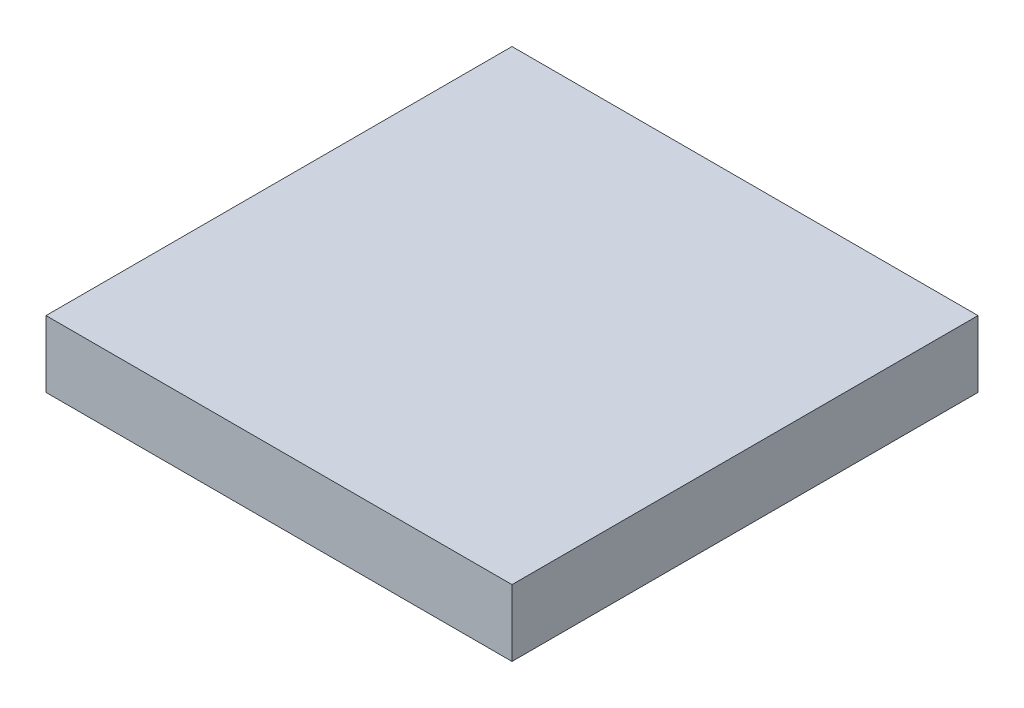
ISO-10303-21;
HEADER;
FILE_DESCRIPTION(('STEP AP214'),'2;1');
FILE_NAME('part.step','',(''),(''),'','','');
FILE_SCHEMA(('AUTOMOTIVE_DESIGN { 1 0 10303 214 1 1 1 1 }'));
ENDSEC;
DATA;
#1=APPLICATION_CONTEXT('core data for automotive mechanical design processes');
#2=APPLICATION_PROTOCOL_DEFINITION('international standard','automotive_design',2000,#1);
#3=PRODUCT_CONTEXT('',#1,'mechanical');
#4=PRODUCT('Part','Part','',(#3));
#5=PRODUCT_RELATED_PRODUCT_CATEGORY('part','',(#4));
#6=PRODUCT_DEFINITION_FORMATION('','',#4);
#7=PRODUCT_DEFINITION_CONTEXT('part definition',#1,'design');
#8=PRODUCT_DEFINITION('design','',#6,#7);
#9=PRODUCT_DEFINITION_SHAPE('','',#8);
#10=(LENGTH_UNIT() NAMED_UNIT(*) SI_UNIT(.MILLI.,.METRE.));
#11=(NAMED_UNIT(*) PLANE_ANGLE_UNIT() SI_UNIT($,.RADIAN.));
#12=(NAMED_UNIT(*) SI_UNIT($,.STERADIAN.) SOLID_ANGLE_UNIT());
#13=UNCERTAINTY_MEASURE_WITH_UNIT(LENGTH_MEASURE(1.E-05),#10,'distance_accuracy_value','');
#14=(GEOMETRIC_REPRESENTATION_CONTEXT(3) GLOBAL_UNCERTAINTY_ASSIGNED_CONTEXT((#13)) GLOBAL_UNIT_ASSIGNED_CONTEXT((#10,
#11,#12)) REPRESENTATION_CONTEXT('',''));
#15=CARTESIAN_POINT('',(0.,0.,0.));
#16=DIRECTION('',(0.,0.,1.));
#17=DIRECTION('',(1.,0.,0.));
#18=AXIS2_PLACEMENT_3D('',#15,#16,#17);
#19=CARTESIAN_POINT('',(9.15,6.8,-37.4));
#20=DIRECTION('',(0.,-1.,0.));
#21=DIRECTION('',(0.,0.,-1.));
#22=AXIS2_PLACEMENT_3D('',#19,#20,#21);
#23=PLANE('',#22);
#24=DIRECTION('',(-1.,0.,0.));
#25=VECTOR('',#24,1.);
#26=CARTESIAN_POINT('',(12.65,6.8,-44.4));
#27=LINE('',#26,#25);
#28=CARTESIAN_POINT('',(16.15,6.8,-44.4));
#29=VERTEX_POINT('',#28);
#30=CARTESIAN_POINT('',(9.15,6.8,-44.4));
#31=VERTEX_POINT('',#30);
#32=EDGE_CURVE('E54',#29,#31,#27,.T.);
#33=ORIENTED_EDGE('',*,*,#32,.F.);
#34=DIRECTION('',(0.,0.,-1.));
#35=VECTOR('',#34,1.);
#36=CARTESIAN_POINT('',(16.15,6.8,-40.9));
#37=LINE('',#36,#35);
#38=CARTESIAN_POINT('',(16.15,6.8,-37.4));
#39=VERTEX_POINT('',#38);
#40=EDGE_CURVE('E69',#39,#29,#37,.T.);
#41=ORIENTED_EDGE('',*,*,#40,.F.);
#42=DIRECTION('',(1.,0.,0.));
#43=VECTOR('',#42,1.);
#44=CARTESIAN_POINT('',(12.65,6.8,-37.4));
#45=LINE('',#44,#43);
#46=CARTESIAN_POINT('',(9.15,6.8,-37.4));
#47=VERTEX_POINT('',#46);
#48=EDGE_CURVE('E21',#47,#39,#45,.T.);
#49=ORIENTED_EDGE('',*,*,#48,.F.);
#50=DIRECTION('',(0.,0.,1.));
#51=VECTOR('',#50,1.);
#52=CARTESIAN_POINT('',(9.15,6.8,-40.9));
#53=LINE('',#52,#51);
#54=EDGE_CURVE('E59',#31,#47,#53,.T.);
#55=ORIENTED_EDGE('',*,*,#54,.F.);
#56=EDGE_LOOP('',(#33,#41,#49,#55));
#57=FACE_BOUND('',#56,.T.);
#58=ADVANCED_FACE('F17',(#57),#23,.T.);
#59=CARTESIAN_POINT('',(16.15,7.8,-37.4));
#60=DIRECTION('',(0.,0.,1.));
#61=DIRECTION('',(-1.,0.,0.));
#62=AXIS2_PLACEMENT_3D('',#59,#60,#61);
#63=PLANE('',#62);
#64=ORIENTED_EDGE('',*,*,#48,.T.);
#65=DIRECTION('',(0.,-1.,0.));
#66=VECTOR('',#65,1.);
#67=CARTESIAN_POINT('',(16.15,7.3,-37.4));
#68=LINE('',#67,#66);
#69=CARTESIAN_POINT('',(16.15,7.8,-37.4));
#70=VERTEX_POINT('',#69);
#71=EDGE_CURVE('E80',#70,#39,#68,.T.);
#72=ORIENTED_EDGE('',*,*,#71,.F.);
#73=DIRECTION('',(-1.,0.,0.));
#74=VECTOR('',#73,1.);
#75=CARTESIAN_POINT('',(12.65,7.8,-37.4));
#76=LINE('',#75,#74);
#77=CARTESIAN_POINT('',(9.15,7.8,-37.4));
#78=VERTEX_POINT('',#77);
#79=EDGE_CURVE('E75',#70,#78,#76,.T.);
#80=ORIENTED_EDGE('',*,*,#79,.T.);
#81=DIRECTION('',(0.,1.,0.));
#82=VECTOR('',#81,1.);
#83=CARTESIAN_POINT('',(9.15,7.3,-37.4));
#84=LINE('',#83,#82);
#85=EDGE_CURVE('E64',#47,#78,#84,.T.);
#86=ORIENTED_EDGE('',*,*,#85,.F.);
#87=EDGE_LOOP('',(#64,#72,#80,#86));
#88=FACE_BOUND('',#87,.T.);
#89=ADVANCED_FACE('F74',(#88),#63,.T.);
#90=CARTESIAN_POINT('',(9.15,7.8,-37.4));
#91=DIRECTION('',(-1.,0.,0.));
#92=DIRECTION('',(0.,0.,-1.));
#93=AXIS2_PLACEMENT_3D('',#90,#91,#92);
#94=PLANE('',#93);
#95=ORIENTED_EDGE('',*,*,#54,.T.);
#96=ORIENTED_EDGE('',*,*,#85,.T.);
#97=DIRECTION('',(0.,0.,-1.));
#98=VECTOR('',#97,1.);
#99=CARTESIAN_POINT('',(9.15,7.8,-40.9));
#100=LINE('',#99,#98);
#101=CARTESIAN_POINT('',(9.15,7.8,-44.4));
#102=VERTEX_POINT('',#101);
#103=EDGE_CURVE('E85',#78,#102,#100,.T.);
#104=ORIENTED_EDGE('',*,*,#103,.T.);
#105=DIRECTION('',(0.,1.,0.));
#106=VECTOR('',#105,1.);
#107=CARTESIAN_POINT('',(9.15,7.3,-44.4));
#108=LINE('',#107,#106);
#109=EDGE_CURVE('E66',#31,#102,#108,.T.);
#110=ORIENTED_EDGE('',*,*,#109,.F.);
#111=EDGE_LOOP('',(#95,#96,#104,#110));
#112=FACE_BOUND('',#111,.T.);
#113=ADVANCED_FACE('F61',(#112),#94,.T.);
#114=CARTESIAN_POINT('',(9.15,7.8,-44.4));
#115=DIRECTION('',(0.,0.,-1.));
#116=DIRECTION('',(1.,0.,0.));
#117=AXIS2_PLACEMENT_3D('',#114,#115,#116);
#118=PLANE('',#117);
#119=ORIENTED_EDGE('',*,*,#32,.T.);
#120=ORIENTED_EDGE('',*,*,#109,.T.);
#121=DIRECTION('',(1.,0.,0.));
#122=VECTOR('',#121,1.);
#123=CARTESIAN_POINT('',(12.65,7.8,-44.4));
#124=LINE('',#123,#122);
#125=CARTESIAN_POINT('',(16.15,7.8,-44.4));
#126=VERTEX_POINT('',#125);
#127=EDGE_CURVE('E27',#102,#126,#124,.T.);
#128=ORIENTED_EDGE('',*,*,#127,.T.);
#129=DIRECTION('',(0.,1.,0.));
#130=VECTOR('',#129,1.);
#131=CARTESIAN_POINT('',(16.15,7.3,-44.4));
#132=LINE('',#131,#130);
#133=EDGE_CURVE('E35',#29,#126,#132,.T.);
#134=ORIENTED_EDGE('',*,*,#133,.F.);
#135=EDGE_LOOP('',(#119,#120,#128,#134));
#136=FACE_BOUND('',#135,.T.);
#137=ADVANCED_FACE('F89',(#136),#118,.T.);
#138=CARTESIAN_POINT('',(16.15,7.8,-44.4));
#139=DIRECTION('',(1.,0.,0.));
#140=DIRECTION('',(0.,0.,1.));
#141=AXIS2_PLACEMENT_3D('',#138,#139,#140);
#142=PLANE('',#141);
#143=ORIENTED_EDGE('',*,*,#40,.T.);
#144=ORIENTED_EDGE('',*,*,#133,.T.);
#145=DIRECTION('',(0.,0.,1.));
#146=VECTOR('',#145,1.);
#147=CARTESIAN_POINT('',(16.15,7.8,-40.9));
#148=LINE('',#147,#146);
#149=EDGE_CURVE('E11',#126,#70,#148,.T.);
#150=ORIENTED_EDGE('',*,*,#149,.T.);
#151=ORIENTED_EDGE('',*,*,#71,.T.);
#152=EDGE_LOOP('',(#143,#144,#150,#151));
#153=FACE_BOUND('',#152,.T.);
#154=ADVANCED_FACE('F91',(#153),#142,.T.);
#155=CARTESIAN_POINT('',(9.15,7.8,-37.4));
#156=DIRECTION('',(0.,-1.,0.));
#157=DIRECTION('',(0.,0.,-1.));
#158=AXIS2_PLACEMENT_3D('',#155,#156,#157);
#159=PLANE('',#158);
#160=ORIENTED_EDGE('',*,*,#127,.F.);
#161=ORIENTED_EDGE('',*,*,#103,.F.);
#162=ORIENTED_EDGE('',*,*,#79,.F.);
#163=ORIENTED_EDGE('',*,*,#149,.F.);
#164=EDGE_LOOP('',(#160,#161,#162,#163));
#165=FACE_BOUND('',#164,.T.);
#166=ADVANCED_FACE('F19',(#165),#159,.F.);
#167=CLOSED_SHELL('',(#58,#89,#113,#137,#154,#166));
#168=MANIFOLD_SOLID_BREP('B1',#167);
#169=ADVANCED_BREP_SHAPE_REPRESENTATION('',(#18,#168),#14);
#170=SHAPE_DEFINITION_REPRESENTATION(#9,#169);
ENDSEC;
END-ISO-10303-21;
